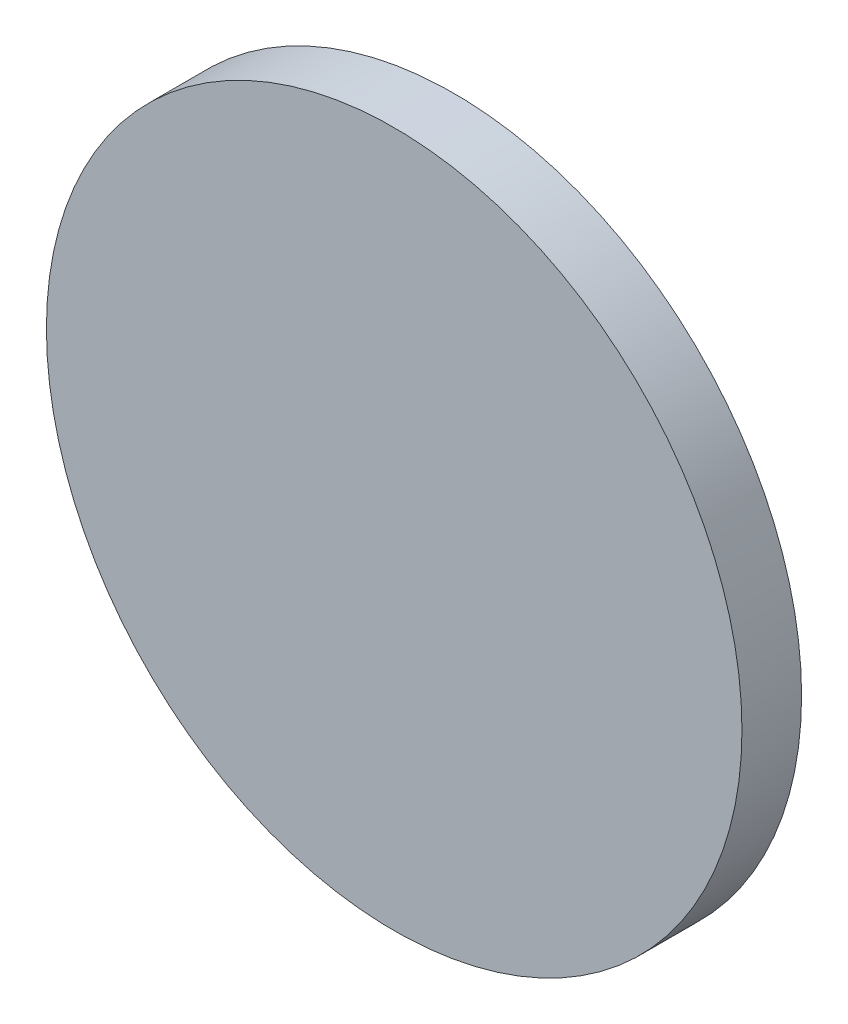
ISO-10303-21;
HEADER;
FILE_DESCRIPTION(('STEP AP214'),'2;1');
FILE_NAME('part.step','',(''),(''),'','','');
FILE_SCHEMA(('AUTOMOTIVE_DESIGN { 1 0 10303 214 1 1 1 1 }'));
ENDSEC;
DATA;
#1=APPLICATION_CONTEXT('core data for automotive mechanical design processes');
#2=APPLICATION_PROTOCOL_DEFINITION('international standard','automotive_design',2000,#1);
#3=PRODUCT_CONTEXT('',#1,'mechanical');
#4=PRODUCT('Part','Part','',(#3));
#5=PRODUCT_RELATED_PRODUCT_CATEGORY('part','',(#4));
#6=PRODUCT_DEFINITION_FORMATION('','',#4);
#7=PRODUCT_DEFINITION_CONTEXT('part definition',#1,'design');
#8=PRODUCT_DEFINITION('design','',#6,#7);
#9=PRODUCT_DEFINITION_SHAPE('','',#8);
#10=(LENGTH_UNIT() NAMED_UNIT(*) SI_UNIT(.MILLI.,.METRE.));
#11=(NAMED_UNIT(*) PLANE_ANGLE_UNIT() SI_UNIT($,.RADIAN.));
#12=(NAMED_UNIT(*) SI_UNIT($,.STERADIAN.) SOLID_ANGLE_UNIT());
#13=UNCERTAINTY_MEASURE_WITH_UNIT(LENGTH_MEASURE(1.E-05),#10,'distance_accuracy_value','');
#14=(GEOMETRIC_REPRESENTATION_CONTEXT(3) GLOBAL_UNCERTAINTY_ASSIGNED_CONTEXT((#13)) GLOBAL_UNIT_ASSIGNED_CONTEXT((#10,
#11,#12)) REPRESENTATION_CONTEXT('',''));
#15=CARTESIAN_POINT('',(0.,0.,0.));
#16=DIRECTION('',(0.,0.,1.));
#17=DIRECTION('',(1.,0.,0.));
#18=AXIS2_PLACEMENT_3D('',#15,#16,#17);
#19=CARTESIAN_POINT('',(7.5692,1.59004,0.76487));
#20=DIRECTION('',(0.,0.,-1.));
#21=DIRECTION('',(-1.,0.,0.));
#22=AXIS2_PLACEMENT_3D('',#19,#20,#21);
#23=PLANE('',#22);
#24=CARTESIAN_POINT('',(7.5692,1.59004,0.76487));
#25=DIRECTION('',(0.,0.,1.));
#26=DIRECTION('',(1.,0.,0.));
#27=AXIS2_PLACEMENT_3D('',#24,#25,#26);
#28=CIRCLE('',#27,0.200024667);
#29=CARTESIAN_POINT('',(7.769224667,1.59004,0.76487));
#30=VERTEX_POINT('',#29);
#31=EDGE_CURVE('E18',#30,#30,#28,.T.);
#32=ORIENTED_EDGE('',*,*,#31,.F.);
#33=EDGE_LOOP('',(#32));
#34=FACE_BOUND('',#33,.T.);
#35=ADVANCED_FACE('F15',(#34),#23,.T.);
#36=CARTESIAN_POINT('',(7.5692,1.59004,0.76487));
#37=DIRECTION('',(0.,0.,1.));
#38=DIRECTION('',(1.,0.,0.));
#39=AXIS2_PLACEMENT_3D('',#36,#37,#38);
#40=CYLINDRICAL_SURFACE('',#39,0.200024667);
#41=CARTESIAN_POINT('',(7.5692,1.59004,0.79916));
#42=DIRECTION('',(0.,0.,1.));
#43=DIRECTION('',(1.,0.,0.));
#44=AXIS2_PLACEMENT_3D('',#41,#42,#43);
#45=CIRCLE('',#44,0.200024667);
#46=CARTESIAN_POINT('',(7.769224667,1.59004,0.79916));
#47=VERTEX_POINT('',#46);
#48=EDGE_CURVE('E10',#47,#47,#45,.T.);
#49=ORIENTED_EDGE('',*,*,#48,.F.);
#50=EDGE_LOOP('',(#49));
#51=FACE_BOUND('',#50,.T.);
#52=ORIENTED_EDGE('',*,*,#31,.T.);
#53=EDGE_LOOP('',(#52));
#54=FACE_BOUND('',#53,.T.);
#55=ADVANCED_FACE('F27',(#51,#54),#40,.T.);
#56=CARTESIAN_POINT('',(7.5692,1.59004,0.79916));
#57=DIRECTION('',(0.,0.,1.));
#58=DIRECTION('',(1.,0.,0.));
#59=AXIS2_PLACEMENT_3D('',#56,#57,#58);
#60=PLANE('',#59);
#61=ORIENTED_EDGE('',*,*,#48,.T.);
#62=EDGE_LOOP('',(#61));
#63=FACE_BOUND('',#62,.T.);
#64=ADVANCED_FACE('F34',(#63),#60,.T.);
#65=CLOSED_SHELL('',(#35,#55,#64));
#66=MANIFOLD_SOLID_BREP('B1',#65);
#67=ADVANCED_BREP_SHAPE_REPRESENTATION('',(#18,#66),#14);
#68=SHAPE_DEFINITION_REPRESENTATION(#9,#67);
ENDSEC;
END-ISO-10303-21;
